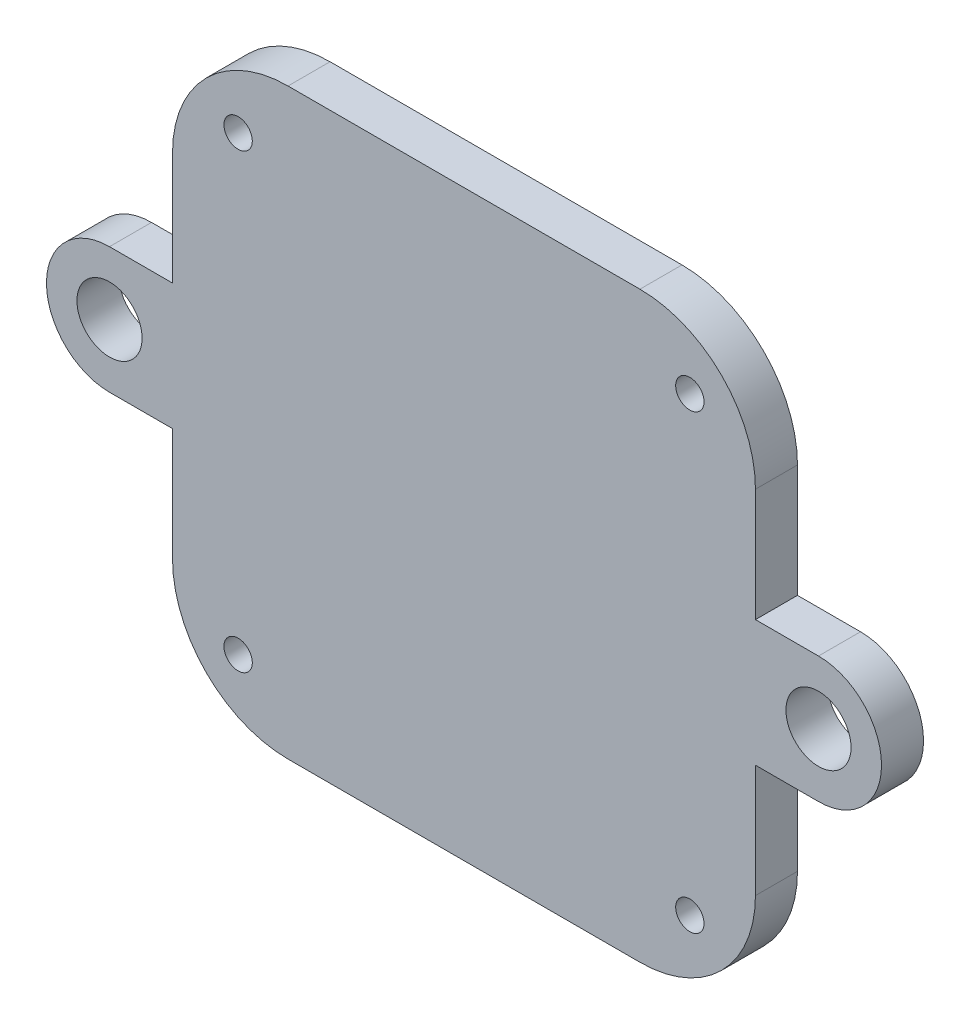
ISO-10303-21;
HEADER;
FILE_DESCRIPTION(('STEP AP214'),'2;1');
FILE_NAME('part.step','',(''),(''),'','','');
FILE_SCHEMA(('AUTOMOTIVE_DESIGN { 1 0 10303 214 1 1 1 1 }'));
ENDSEC;
DATA;
#1=APPLICATION_CONTEXT('core data for automotive mechanical design processes');
#2=APPLICATION_PROTOCOL_DEFINITION('international standard','automotive_design',2000,#1);
#3=PRODUCT_CONTEXT('',#1,'mechanical');
#4=PRODUCT('Part','Part','',(#3));
#5=PRODUCT_RELATED_PRODUCT_CATEGORY('part','',(#4));
#6=PRODUCT_DEFINITION_FORMATION('','',#4);
#7=PRODUCT_DEFINITION_CONTEXT('part definition',#1,'design');
#8=PRODUCT_DEFINITION('design','',#6,#7);
#9=PRODUCT_DEFINITION_SHAPE('','',#8);
#10=(LENGTH_UNIT() NAMED_UNIT(*) SI_UNIT(.MILLI.,.METRE.));
#11=(NAMED_UNIT(*) PLANE_ANGLE_UNIT() SI_UNIT($,.RADIAN.));
#12=(NAMED_UNIT(*) SI_UNIT($,.STERADIAN.) SOLID_ANGLE_UNIT());
#13=UNCERTAINTY_MEASURE_WITH_UNIT(LENGTH_MEASURE(1.E-05),#10,'distance_accuracy_value','');
#14=(GEOMETRIC_REPRESENTATION_CONTEXT(3) GLOBAL_UNCERTAINTY_ASSIGNED_CONTEXT((#13)) GLOBAL_UNIT_ASSIGNED_CONTEXT((#10,
#11,#12)) REPRESENTATION_CONTEXT('',''));
#15=CARTESIAN_POINT('',(0.,0.,0.));
#16=DIRECTION('',(0.,0.,1.));
#17=DIRECTION('',(1.,0.,0.));
#18=AXIS2_PLACEMENT_3D('',#15,#16,#17);
#19=CARTESIAN_POINT('',(33.744938630528,0.,-4.));
#20=DIRECTION('',(0.,0.,1.));
#21=DIRECTION('',(1.,0.,0.));
#22=AXIS2_PLACEMENT_3D('',#19,#20,#21);
#23=CYLINDRICAL_SURFACE('',#22,6.);
#24=CARTESIAN_POINT('',(33.744938630528,0.,0.));
#25=DIRECTION('',(0.,0.,1.));
#26=DIRECTION('',(1.,0.,0.));
#27=AXIS2_PLACEMENT_3D('',#24,#25,#26);
#28=CIRCLE('',#27,6.);
#29=CARTESIAN_POINT('',(33.744938630528,6.00000000000001,0.));
#30=VERTEX_POINT('',#29);
#31=CARTESIAN_POINT('',(33.744938630528,-6.,0.));
#32=VERTEX_POINT('',#31);
#33=EDGE_CURVE('E203',#30,#32,#28,.F.);
#34=ORIENTED_EDGE('',*,*,#33,.T.);
#35=DIRECTION('',(0.,0.,1.));
#36=VECTOR('',#35,1.);
#37=CARTESIAN_POINT('',(33.744938630528,-6.,-4.));
#38=LINE('',#37,#36);
#39=CARTESIAN_POINT('',(33.744938630528,-6.,-4.));
#40=VERTEX_POINT('',#39);
#41=EDGE_CURVE('E11',#40,#32,#38,.T.);
#42=ORIENTED_EDGE('',*,*,#41,.F.);
#43=CARTESIAN_POINT('',(33.744938630528,0.,-4.));
#44=DIRECTION('',(0.,0.,1.));
#45=DIRECTION('',(1.,0.,0.));
#46=AXIS2_PLACEMENT_3D('',#43,#44,#45);
#47=CIRCLE('',#46,6.);
#48=CARTESIAN_POINT('',(33.744938630528,6.00000000000001,-4.));
#49=VERTEX_POINT('',#48);
#50=EDGE_CURVE('E273',#49,#40,#47,.F.);
#51=ORIENTED_EDGE('',*,*,#50,.F.);
#52=DIRECTION('',(0.,0.,1.));
#53=VECTOR('',#52,1.);
#54=CARTESIAN_POINT('',(33.744938630528,6.00000000000001,-4.));
#55=LINE('',#54,#53);
#56=EDGE_CURVE('E126',#49,#30,#55,.T.);
#57=ORIENTED_EDGE('',*,*,#56,.T.);
#58=EDGE_LOOP('',(#34,#42,#51,#57));
#59=FACE_BOUND('',#58,.T.);
#60=ADVANCED_FACE('F40',(#59),#23,.T.);
#61=CARTESIAN_POINT('',(0.,-6.00000000000002,-4.));
#62=DIRECTION('',(0.,1.,0.));
#63=DIRECTION('',(-1.,0.,0.));
#64=AXIS2_PLACEMENT_3D('',#61,#62,#63);
#65=PLANE('',#64);
#66=DIRECTION('',(-1.,0.,0.));
#67=VECTOR('',#66,1.);
#68=CARTESIAN_POINT('',(0.,-6.00000000000002,0.));
#69=LINE('',#68,#67);
#70=CARTESIAN_POINT('',(27.7449386305214,-6.00000000000002,0.));
#71=VERTEX_POINT('',#70);
#72=EDGE_CURVE('E119',#32,#71,#69,.T.);
#73=ORIENTED_EDGE('',*,*,#72,.T.);
#74=DIRECTION('',(0.,0.,1.));
#75=VECTOR('',#74,1.);
#76=CARTESIAN_POINT('',(27.7449386305214,-6.00000000000002,-4.));
#77=LINE('',#76,#75);
#78=CARTESIAN_POINT('',(27.7449386305214,-6.00000000000002,-4.));
#79=VERTEX_POINT('',#78);
#80=EDGE_CURVE('E49',#79,#71,#77,.T.);
#81=ORIENTED_EDGE('',*,*,#80,.F.);
#82=DIRECTION('',(-1.,0.,0.));
#83=VECTOR('',#82,1.);
#84=CARTESIAN_POINT('',(0.,-6.00000000000002,-4.));
#85=LINE('',#84,#83);
#86=EDGE_CURVE('E57',#40,#79,#85,.T.);
#87=ORIENTED_EDGE('',*,*,#86,.F.);
#88=ORIENTED_EDGE('',*,*,#41,.T.);
#89=EDGE_LOOP('',(#73,#81,#87,#88));
#90=FACE_BOUND('',#89,.T.);
#91=ADVANCED_FACE('F424',(#90),#65,.F.);
#92=CARTESIAN_POINT('',(27.7449386305203,5.17503071897234E-12,-4.));
#93=DIRECTION('',(1.,1.86521613469336E-13,0.));
#94=DIRECTION('',(-1.86521613469336E-13,1.,0.));
#95=AXIS2_PLACEMENT_3D('',#92,#93,#94);
#96=PLANE('',#95);
#97=DIRECTION('',(-1.86521613469336E-13,1.,0.));
#98=VECTOR('',#97,1.);
#99=CARTESIAN_POINT('',(27.7449386305203,5.17503071897234E-12,0.));
#100=LINE('',#99,#98);
#101=CARTESIAN_POINT('',(27.7449386305234,-16.749999513438,0.));
#102=VERTEX_POINT('',#101);
#103=EDGE_CURVE('E173',#102,#71,#100,.T.);
#104=ORIENTED_EDGE('',*,*,#103,.F.);
#105=DIRECTION('',(0.,0.,1.));
#106=VECTOR('',#105,1.);
#107=CARTESIAN_POINT('',(27.7449386305234,-16.749999513438,-4.));
#108=LINE('',#107,#106);
#109=CARTESIAN_POINT('',(27.7449386305234,-16.749999513438,-4.));
#110=VERTEX_POINT('',#109);
#111=EDGE_CURVE('E169',#110,#102,#108,.T.);
#112=ORIENTED_EDGE('',*,*,#111,.F.);
#113=DIRECTION('',(-1.86521613469336E-13,1.,0.));
#114=VECTOR('',#113,1.);
#115=CARTESIAN_POINT('',(27.7449386305203,5.17503071897234E-12,-4.));
#116=LINE('',#115,#114);
#117=EDGE_CURVE('E172',#110,#79,#116,.T.);
#118=ORIENTED_EDGE('',*,*,#117,.T.);
#119=ORIENTED_EDGE('',*,*,#80,.T.);
#120=EDGE_LOOP('',(#104,#112,#118,#119));
#121=FACE_BOUND('',#120,.T.);
#122=ADVANCED_FACE('F171',(#121),#96,.T.);
#123=CARTESIAN_POINT('',(16.75,-16.75,-4.));
#124=DIRECTION('',(0.,0.,1.));
#125=DIRECTION('',(1.,0.,0.));
#126=AXIS2_PLACEMENT_3D('',#123,#124,#125);
#127=CYLINDRICAL_SURFACE('',#126,10.9949386305203);
#128=CARTESIAN_POINT('',(16.75,-16.75,0.));
#129=DIRECTION('',(0.,0.,1.));
#130=DIRECTION('',(1.,0.,0.));
#131=AXIS2_PLACEMENT_3D('',#128,#129,#130);
#132=CIRCLE('',#131,10.9949386305203);
#133=CARTESIAN_POINT('',(16.75,-27.7449386305172,0.));
#134=VERTEX_POINT('',#133);
#135=EDGE_CURVE('E250',#134,#102,#132,.T.);
#136=ORIENTED_EDGE('',*,*,#135,.F.);
#137=DIRECTION('',(0.,0.,1.));
#138=VECTOR('',#137,1.);
#139=CARTESIAN_POINT('',(16.75,-27.7449386305172,-4.));
#140=LINE('',#139,#138);
#141=CARTESIAN_POINT('',(16.75,-27.7449386305172,-4.));
#142=VERTEX_POINT('',#141);
#143=EDGE_CURVE('E178',#142,#134,#140,.T.);
#144=ORIENTED_EDGE('',*,*,#143,.F.);
#145=CARTESIAN_POINT('',(16.75,-16.75,-4.));
#146=DIRECTION('',(0.,0.,1.));
#147=DIRECTION('',(1.,0.,0.));
#148=AXIS2_PLACEMENT_3D('',#145,#146,#147);
#149=CIRCLE('',#148,10.9949386305203);
#150=EDGE_CURVE('E184',#142,#110,#149,.T.);
#151=ORIENTED_EDGE('',*,*,#150,.T.);
#152=ORIENTED_EDGE('',*,*,#111,.T.);
#153=EDGE_LOOP('',(#136,#144,#151,#152));
#154=FACE_BOUND('',#153,.T.);
#155=ADVANCED_FACE('F186',(#154),#127,.T.);
#156=CARTESIAN_POINT('',(1.03098335431308E-11,-27.7449386305234,-4.));
#157=DIRECTION('',(-3.71593308618407E-13,1.,0.));
#158=DIRECTION('',(-1.,-3.71593308618407E-13,0.));
#159=AXIS2_PLACEMENT_3D('',#156,#157,#158);
#160=PLANE('',#159);
#161=DIRECTION('',(-1.,-3.71593308618407E-13,0.));
#162=VECTOR('',#161,1.);
#163=CARTESIAN_POINT('',(1.03098335431308E-11,-27.7449386305234,0.));
#164=LINE('',#163,#162);
#165=CARTESIAN_POINT('',(-16.7499995287669,-27.7449386305296,0.));
#166=VERTEX_POINT('',#165);
#167=EDGE_CURVE('E246',#134,#166,#164,.T.);
#168=ORIENTED_EDGE('',*,*,#167,.T.);
#169=DIRECTION('',(0.,0.,1.));
#170=VECTOR('',#169,1.);
#171=CARTESIAN_POINT('',(-16.7499995287669,-27.7449386305296,-4.));
#172=LINE('',#171,#170);
#173=CARTESIAN_POINT('',(-16.7499995287669,-27.7449386305296,-4.));
#174=VERTEX_POINT('',#173);
#175=EDGE_CURVE('E277',#174,#166,#172,.T.);
#176=ORIENTED_EDGE('',*,*,#175,.F.);
#177=DIRECTION('',(-1.,-3.71593308618407E-13,0.));
#178=VECTOR('',#177,1.);
#179=CARTESIAN_POINT('',(1.03098335431308E-11,-27.7449386305234,-4.));
#180=LINE('',#179,#178);
#181=EDGE_CURVE('E188',#142,#174,#180,.T.);
#182=ORIENTED_EDGE('',*,*,#181,.F.);
#183=ORIENTED_EDGE('',*,*,#143,.T.);
#184=EDGE_LOOP('',(#168,#176,#182,#183));
#185=FACE_BOUND('',#184,.T.);
#186=ADVANCED_FACE('F427',(#185),#160,.F.);
#187=CARTESIAN_POINT('',(-16.75,-16.75,-4.));
#188=DIRECTION('',(0.,0.,1.));
#189=DIRECTION('',(1.,0.,0.));
#190=AXIS2_PLACEMENT_3D('',#187,#188,#189);
#191=CYLINDRICAL_SURFACE('',#190,10.9949386305288);
#192=CARTESIAN_POINT('',(-16.75,-16.75,0.));
#193=DIRECTION('',(0.,0.,1.));
#194=DIRECTION('',(1.,0.,0.));
#195=AXIS2_PLACEMENT_3D('',#192,#193,#194);
#196=CIRCLE('',#195,10.9949386305288);
#197=CARTESIAN_POINT('',(-27.744938630528,-16.7500000000466,0.));
#198=VERTEX_POINT('',#197);
#199=EDGE_CURVE('E242',#198,#166,#196,.T.);
#200=ORIENTED_EDGE('',*,*,#199,.F.);
#201=DIRECTION('',(0.,0.,1.));
#202=VECTOR('',#201,1.);
#203=CARTESIAN_POINT('',(-27.744938630528,-16.7500000000466,-4.));
#204=LINE('',#203,#202);
#205=CARTESIAN_POINT('',(-27.744938630528,-16.7500000000466,-4.));
#206=VERTEX_POINT('',#205);
#207=EDGE_CURVE('E279',#206,#198,#204,.T.);
#208=ORIENTED_EDGE('',*,*,#207,.F.);
#209=CARTESIAN_POINT('',(-16.75,-16.75,-4.));
#210=DIRECTION('',(0.,0.,1.));
#211=DIRECTION('',(1.,0.,0.));
#212=AXIS2_PLACEMENT_3D('',#209,#210,#211);
#213=CIRCLE('',#212,10.9949386305288);
#214=EDGE_CURVE('E191',#206,#174,#213,.T.);
#215=ORIENTED_EDGE('',*,*,#214,.T.);
#216=ORIENTED_EDGE('',*,*,#175,.T.);
#217=EDGE_LOOP('',(#200,#208,#215,#216));
#218=FACE_BOUND('',#217,.T.);
#219=ADVANCED_FACE('F380',(#218),#191,.T.);
#220=CARTESIAN_POINT('',(-27.7449386305288,-1.36487482276882E-12,-4.));
#221=DIRECTION('',(-1.,0.,0.));
#222=DIRECTION('',(0.,-1.,0.));
#223=AXIS2_PLACEMENT_3D('',#220,#221,#222);
#224=PLANE('',#223);
#225=DIRECTION('',(0.,-1.,0.));
#226=VECTOR('',#225,1.);
#227=CARTESIAN_POINT('',(-27.7449386305288,-1.36487482276882E-12,0.));
#228=LINE('',#227,#226);
#229=CARTESIAN_POINT('',(-27.7449386305285,-6.00000000000002,0.));
#230=VERTEX_POINT('',#229);
#231=EDGE_CURVE('E238',#230,#198,#228,.T.);
#232=ORIENTED_EDGE('',*,*,#231,.F.);
#233=DIRECTION('',(0.,0.,1.));
#234=VECTOR('',#233,1.);
#235=CARTESIAN_POINT('',(-27.7449386305285,-6.00000000000002,-4.));
#236=LINE('',#235,#234);
#237=CARTESIAN_POINT('',(-27.7449386305285,-6.00000000000002,-4.));
#238=VERTEX_POINT('',#237);
#239=EDGE_CURVE('E282',#238,#230,#236,.T.);
#240=ORIENTED_EDGE('',*,*,#239,.F.);
#241=DIRECTION('',(0.,-1.,0.));
#242=VECTOR('',#241,1.);
#243=CARTESIAN_POINT('',(-27.7449386305288,-1.36487482276882E-12,-4.));
#244=LINE('',#243,#242);
#245=EDGE_CURVE('E372',#238,#206,#244,.T.);
#246=ORIENTED_EDGE('',*,*,#245,.T.);
#247=ORIENTED_EDGE('',*,*,#207,.T.);
#248=EDGE_LOOP('',(#232,#240,#246,#247));
#249=FACE_BOUND('',#248,.T.);
#250=ADVANCED_FACE('F385',(#249),#224,.T.);
#251=CARTESIAN_POINT('',(0.,-6.00000000000002,-4.));
#252=DIRECTION('',(0.,1.,0.));
#253=DIRECTION('',(-1.,0.,0.));
#254=AXIS2_PLACEMENT_3D('',#251,#252,#253);
#255=PLANE('',#254);
#256=DIRECTION('',(-1.,0.,0.));
#257=VECTOR('',#256,1.);
#258=CARTESIAN_POINT('',(0.,-6.00000000000002,0.));
#259=LINE('',#258,#257);
#260=CARTESIAN_POINT('',(-33.744938630528,-6.00000000000001,0.));
#261=VERTEX_POINT('',#260);
#262=EDGE_CURVE('E234',#230,#261,#259,.T.);
#263=ORIENTED_EDGE('',*,*,#262,.T.);
#264=DIRECTION('',(0.,0.,1.));
#265=VECTOR('',#264,1.);
#266=CARTESIAN_POINT('',(-33.744938630528,-6.00000000000001,-4.));
#267=LINE('',#266,#265);
#268=CARTESIAN_POINT('',(-33.744938630528,-6.00000000000001,-4.));
#269=VERTEX_POINT('',#268);
#270=EDGE_CURVE('E285',#269,#261,#267,.T.);
#271=ORIENTED_EDGE('',*,*,#270,.F.);
#272=DIRECTION('',(-1.,0.,0.));
#273=VECTOR('',#272,1.);
#274=CARTESIAN_POINT('',(0.,-6.00000000000002,-4.));
#275=LINE('',#274,#273);
#276=EDGE_CURVE('E369',#238,#269,#275,.T.);
#277=ORIENTED_EDGE('',*,*,#276,.F.);
#278=ORIENTED_EDGE('',*,*,#239,.T.);
#279=EDGE_LOOP('',(#263,#271,#277,#278));
#280=FACE_BOUND('',#279,.T.);
#281=ADVANCED_FACE('F390',(#280),#255,.F.);
#282=CARTESIAN_POINT('',(-33.744938630528,0.,-4.));
#283=DIRECTION('',(0.,0.,1.));
#284=DIRECTION('',(1.,0.,0.));
#285=AXIS2_PLACEMENT_3D('',#282,#283,#284);
#286=CYLINDRICAL_SURFACE('',#285,6.);
#287=CARTESIAN_POINT('',(-33.744938630528,0.,0.));
#288=DIRECTION('',(0.,0.,1.));
#289=DIRECTION('',(1.,0.,0.));
#290=AXIS2_PLACEMENT_3D('',#287,#288,#289);
#291=CIRCLE('',#290,6.);
#292=CARTESIAN_POINT('',(-33.744938630528,6.00000000000001,0.));
#293=VERTEX_POINT('',#292);
#294=EDGE_CURVE('E230',#293,#261,#291,.T.);
#295=ORIENTED_EDGE('',*,*,#294,.F.);
#296=DIRECTION('',(0.,0.,1.));
#297=VECTOR('',#296,1.);
#298=CARTESIAN_POINT('',(-33.744938630528,6.00000000000001,-4.));
#299=LINE('',#298,#297);
#300=CARTESIAN_POINT('',(-33.744938630528,6.00000000000001,-4.));
#301=VERTEX_POINT('',#300);
#302=EDGE_CURVE('E288',#301,#293,#299,.T.);
#303=ORIENTED_EDGE('',*,*,#302,.F.);
#304=CARTESIAN_POINT('',(-33.744938630528,0.,-4.));
#305=DIRECTION('',(0.,0.,1.));
#306=DIRECTION('',(1.,0.,0.));
#307=AXIS2_PLACEMENT_3D('',#304,#305,#306);
#308=CIRCLE('',#307,6.);
#309=EDGE_CURVE('E365',#301,#269,#308,.T.);
#310=ORIENTED_EDGE('',*,*,#309,.T.);
#311=ORIENTED_EDGE('',*,*,#270,.T.);
#312=EDGE_LOOP('',(#295,#303,#310,#311));
#313=FACE_BOUND('',#312,.T.);
#314=ADVANCED_FACE('F637',(#313),#286,.T.);
#315=CARTESIAN_POINT('',(0.,6.00000000000002,-4.));
#316=DIRECTION('',(0.,1.,0.));
#317=DIRECTION('',(-1.,0.,0.));
#318=AXIS2_PLACEMENT_3D('',#315,#316,#317);
#319=PLANE('',#318);
#320=DIRECTION('',(-1.,0.,0.));
#321=VECTOR('',#320,1.);
#322=CARTESIAN_POINT('',(0.,6.00000000000002,0.));
#323=LINE('',#322,#321);
#324=CARTESIAN_POINT('',(-27.7449386305291,6.00000000000002,0.));
#325=VERTEX_POINT('',#324);
#326=EDGE_CURVE('E226',#325,#293,#323,.T.);
#327=ORIENTED_EDGE('',*,*,#326,.F.);
#328=DIRECTION('',(0.,0.,1.));
#329=VECTOR('',#328,1.);
#330=CARTESIAN_POINT('',(-27.7449386305291,6.00000000000002,-4.));
#331=LINE('',#330,#329);
#332=CARTESIAN_POINT('',(-27.7449386305291,6.00000000000002,-4.));
#333=VERTEX_POINT('',#332);
#334=EDGE_CURVE('E290',#333,#325,#331,.T.);
#335=ORIENTED_EDGE('',*,*,#334,.F.);
#336=DIRECTION('',(-1.,0.,0.));
#337=VECTOR('',#336,1.);
#338=CARTESIAN_POINT('',(0.,6.00000000000002,-4.));
#339=LINE('',#338,#337);
#340=EDGE_CURVE('E361',#333,#301,#339,.T.);
#341=ORIENTED_EDGE('',*,*,#340,.T.);
#342=ORIENTED_EDGE('',*,*,#302,.T.);
#343=EDGE_LOOP('',(#327,#335,#341,#342));
#344=FACE_BOUND('',#343,.T.);
#345=ADVANCED_FACE('F397',(#344),#319,.T.);
#346=CARTESIAN_POINT('',(-27.7449386305288,-1.36487482276882E-12,-4.));
#347=DIRECTION('',(-1.,0.,0.));
#348=DIRECTION('',(0.,-1.,0.));
#349=AXIS2_PLACEMENT_3D('',#346,#347,#348);
#350=PLANE('',#349);
#351=DIRECTION('',(0.,-1.,0.));
#352=VECTOR('',#351,1.);
#353=CARTESIAN_POINT('',(-27.7449386305288,-1.36487482276882E-12,0.));
#354=LINE('',#353,#352);
#355=CARTESIAN_POINT('',(-27.7449386305296,16.7499999999996,0.));
#356=VERTEX_POINT('',#355);
#357=EDGE_CURVE('E222',#356,#325,#354,.T.);
#358=ORIENTED_EDGE('',*,*,#357,.F.);
#359=DIRECTION('',(0.,0.,1.));
#360=VECTOR('',#359,1.);
#361=CARTESIAN_POINT('',(-27.7449386305296,16.7499999999996,-4.));
#362=LINE('',#361,#360);
#363=CARTESIAN_POINT('',(-27.7449386305296,16.7499999999996,-4.));
#364=VERTEX_POINT('',#363);
#365=EDGE_CURVE('E293',#364,#356,#362,.T.);
#366=ORIENTED_EDGE('',*,*,#365,.F.);
#367=DIRECTION('',(0.,-1.,0.));
#368=VECTOR('',#367,1.);
#369=CARTESIAN_POINT('',(-27.7449386305288,-1.36487482276882E-12,-4.));
#370=LINE('',#369,#368);
#371=EDGE_CURVE('E357',#364,#333,#370,.T.);
#372=ORIENTED_EDGE('',*,*,#371,.T.);
#373=ORIENTED_EDGE('',*,*,#334,.T.);
#374=EDGE_LOOP('',(#358,#366,#372,#373));
#375=FACE_BOUND('',#374,.T.);
#376=ADVANCED_FACE('F401',(#375),#350,.T.);
#377=CARTESIAN_POINT('',(-16.749999999938,16.750000000062,-4.));
#378=DIRECTION('',(0.,0.,1.));
#379=DIRECTION('',(1.,0.,0.));
#380=AXIS2_PLACEMENT_3D('',#377,#378,#379);
#381=CYLINDRICAL_SURFACE('',#380,10.9949386305635);
#382=CARTESIAN_POINT('',(-16.749999999938,16.750000000062,0.));
#383=DIRECTION('',(0.,0.,1.));
#384=DIRECTION('',(1.,0.,0.));
#385=AXIS2_PLACEMENT_3D('',#382,#383,#384);
#386=CIRCLE('',#385,10.9949386305635);
#387=CARTESIAN_POINT('',(-16.75,27.7449386305975,0.));
#388=VERTEX_POINT('',#387);
#389=EDGE_CURVE('E219',#388,#356,#386,.T.);
#390=ORIENTED_EDGE('',*,*,#389,.F.);
#391=DIRECTION('',(0.,0.,1.));
#392=VECTOR('',#391,1.);
#393=CARTESIAN_POINT('',(-16.75,27.7449386305975,-4.));
#394=LINE('',#393,#392);
#395=CARTESIAN_POINT('',(-16.75,27.7449386305975,-4.));
#396=VERTEX_POINT('',#395);
#397=EDGE_CURVE('E296',#396,#388,#394,.T.);
#398=ORIENTED_EDGE('',*,*,#397,.F.);
#399=CARTESIAN_POINT('',(-16.749999999938,16.750000000062,-4.));
#400=DIRECTION('',(0.,0.,1.));
#401=DIRECTION('',(1.,0.,0.));
#402=AXIS2_PLACEMENT_3D('',#399,#400,#401);
#403=CIRCLE('',#402,10.9949386305635);
#404=EDGE_CURVE('E353',#396,#364,#403,.T.);
#405=ORIENTED_EDGE('',*,*,#404,.T.);
#406=ORIENTED_EDGE('',*,*,#365,.T.);
#407=EDGE_LOOP('',(#390,#398,#405,#406));
#408=FACE_BOUND('',#407,.T.);
#409=ADVANCED_FACE('F406',(#408),#381,.T.);
#410=CARTESIAN_POINT('',(3.95899904431702E-11,27.7449386305736,-4.));
#411=DIRECTION('',(1.42692658182866E-12,1.,0.));
#412=DIRECTION('',(-1.,1.42692658182866E-12,0.));
#413=AXIS2_PLACEMENT_3D('',#410,#411,#412);
#414=PLANE('',#413);
#415=DIRECTION('',(-1.,1.42692658182866E-12,0.));
#416=VECTOR('',#415,1.);
#417=CARTESIAN_POINT('',(3.95899904431702E-11,27.7449386305736,0.));
#418=LINE('',#417,#416);
#419=CARTESIAN_POINT('',(16.7499997286173,27.7449386305497,0.));
#420=VERTEX_POINT('',#419);
#421=EDGE_CURVE('E216',#420,#388,#418,.T.);
#422=ORIENTED_EDGE('',*,*,#421,.F.);
#423=DIRECTION('',(0.,0.,1.));
#424=VECTOR('',#423,1.);
#425=CARTESIAN_POINT('',(16.7499997286173,27.7449386305497,-4.));
#426=LINE('',#425,#424);
#427=CARTESIAN_POINT('',(16.7499997286173,27.7449386305497,-4.));
#428=VERTEX_POINT('',#427);
#429=EDGE_CURVE('E298',#428,#420,#426,.T.);
#430=ORIENTED_EDGE('',*,*,#429,.F.);
#431=DIRECTION('',(-1.,1.42692658182866E-12,0.));
#432=VECTOR('',#431,1.);
#433=CARTESIAN_POINT('',(3.95899904431702E-11,27.7449386305736,-4.));
#434=LINE('',#433,#432);
#435=EDGE_CURVE('E350',#428,#396,#434,.T.);
#436=ORIENTED_EDGE('',*,*,#435,.T.);
#437=ORIENTED_EDGE('',*,*,#397,.T.);
#438=EDGE_LOOP('',(#422,#430,#436,#437));
#439=FACE_BOUND('',#438,.T.);
#440=ADVANCED_FACE('F409',(#439),#414,.T.);
#441=CARTESIAN_POINT('',(16.75,16.75,-4.));
#442=DIRECTION('',(0.,0.,1.));
#443=DIRECTION('',(1.,0.,0.));
#444=AXIS2_PLACEMENT_3D('',#441,#442,#443);
#445=CYLINDRICAL_SURFACE('',#444,10.9949386305334);
#446=CARTESIAN_POINT('',(16.75,16.75,0.));
#447=DIRECTION('',(0.,0.,1.));
#448=DIRECTION('',(1.,0.,0.));
#449=AXIS2_PLACEMENT_3D('',#446,#447,#448);
#450=CIRCLE('',#449,10.9949386305334);
#451=CARTESIAN_POINT('',(27.7449386305172,16.7500000000003,0.));
#452=VERTEX_POINT('',#451);
#453=EDGE_CURVE('E213',#452,#420,#450,.T.);
#454=ORIENTED_EDGE('',*,*,#453,.F.);
#455=DIRECTION('',(0.,0.,1.));
#456=VECTOR('',#455,1.);
#457=CARTESIAN_POINT('',(27.7449386305172,16.7500000000003,-4.));
#458=LINE('',#457,#456);
#459=CARTESIAN_POINT('',(27.7449386305172,16.7500000000003,-4.));
#460=VERTEX_POINT('',#459);
#461=EDGE_CURVE('E300',#460,#452,#458,.T.);
#462=ORIENTED_EDGE('',*,*,#461,.F.);
#463=CARTESIAN_POINT('',(16.75,16.75,-4.));
#464=DIRECTION('',(0.,0.,1.));
#465=DIRECTION('',(1.,0.,0.));
#466=AXIS2_PLACEMENT_3D('',#463,#464,#465);
#467=CIRCLE('',#466,10.9949386305334);
#468=EDGE_CURVE('E347',#460,#428,#467,.T.);
#469=ORIENTED_EDGE('',*,*,#468,.T.);
#470=ORIENTED_EDGE('',*,*,#429,.T.);
#471=EDGE_LOOP('',(#454,#462,#469,#470));
#472=FACE_BOUND('',#471,.T.);
#473=ADVANCED_FACE('F414',(#472),#445,.T.);
#474=CARTESIAN_POINT('',(27.7449386305203,5.17503071897234E-12,-4.));
#475=DIRECTION('',(1.,1.86521613469336E-13,0.));
#476=DIRECTION('',(-1.86521613469336E-13,1.,0.));
#477=AXIS2_PLACEMENT_3D('',#474,#475,#476);
#478=PLANE('',#477);
#479=DIRECTION('',(-1.86521613469336E-13,1.,0.));
#480=VECTOR('',#479,1.);
#481=CARTESIAN_POINT('',(27.7449386305203,5.17503071897234E-12,0.));
#482=LINE('',#481,#480);
#483=CARTESIAN_POINT('',(27.7449386305192,6.00000000000002,0.));
#484=VERTEX_POINT('',#483);
#485=EDGE_CURVE('E210',#484,#452,#482,.T.);
#486=ORIENTED_EDGE('',*,*,#485,.F.);
#487=DIRECTION('',(0.,0.,1.));
#488=VECTOR('',#487,1.);
#489=CARTESIAN_POINT('',(27.7449386305192,6.00000000000002,-4.));
#490=LINE('',#489,#488);
#491=CARTESIAN_POINT('',(27.7449386305192,6.00000000000002,-4.));
#492=VERTEX_POINT('',#491);
#493=EDGE_CURVE('E302',#492,#484,#490,.T.);
#494=ORIENTED_EDGE('',*,*,#493,.F.);
#495=DIRECTION('',(-1.86521613469336E-13,1.,0.));
#496=VECTOR('',#495,1.);
#497=CARTESIAN_POINT('',(27.7449386305203,5.17503071897234E-12,-4.));
#498=LINE('',#497,#496);
#499=EDGE_CURVE('E344',#492,#460,#498,.T.);
#500=ORIENTED_EDGE('',*,*,#499,.T.);
#501=ORIENTED_EDGE('',*,*,#461,.T.);
#502=EDGE_LOOP('',(#486,#494,#500,#501));
#503=FACE_BOUND('',#502,.T.);
#504=ADVANCED_FACE('F417',(#503),#478,.T.);
#505=CARTESIAN_POINT('',(-33.744938630528,0.,-4.));
#506=DIRECTION('',(0.,0.,1.));
#507=DIRECTION('',(1.,0.,0.));
#508=AXIS2_PLACEMENT_3D('',#505,#506,#507);
#509=CYLINDRICAL_SURFACE('',#508,3.1);
#510=CARTESIAN_POINT('',(-33.744938630528,0.,-4.));
#511=DIRECTION('',(0.,0.,1.));
#512=DIRECTION('',(1.,0.,0.));
#513=AXIS2_PLACEMENT_3D('',#510,#511,#512);
#514=CIRCLE('',#513,3.1);
#515=CARTESIAN_POINT('',(-30.644938630528,0.,-4.));
#516=VERTEX_POINT('',#515);
#517=EDGE_CURVE('E196',#516,#516,#514,.T.);
#518=ORIENTED_EDGE('',*,*,#517,.F.);
#519=EDGE_LOOP('',(#518));
#520=FACE_BOUND('',#519,.T.);
#521=CARTESIAN_POINT('',(-33.744938630528,0.,0.));
#522=DIRECTION('',(0.,0.,1.));
#523=DIRECTION('',(1.,0.,0.));
#524=AXIS2_PLACEMENT_3D('',#521,#522,#523);
#525=CIRCLE('',#524,3.1);
#526=CARTESIAN_POINT('',(-30.644938630528,0.,0.));
#527=VERTEX_POINT('',#526);
#528=EDGE_CURVE('E267',#527,#527,#525,.T.);
#529=ORIENTED_EDGE('',*,*,#528,.T.);
#530=EDGE_LOOP('',(#529));
#531=FACE_BOUND('',#530,.T.);
#532=ADVANCED_FACE('F460',(#520,#531),#509,.F.);
#533=CARTESIAN_POINT('',(-21.5,-21.5,-4.));
#534=DIRECTION('',(0.,0.,1.));
#535=DIRECTION('',(1.,0.,0.));
#536=AXIS2_PLACEMENT_3D('',#533,#534,#535);
#537=CYLINDRICAL_SURFACE('',#536,1.35);
#538=CARTESIAN_POINT('',(-21.5,-21.5,-2.55));
#539=DIRECTION('',(0.,0.,-1.));
#540=DIRECTION('',(-1.,0.,0.));
#541=AXIS2_PLACEMENT_3D('',#538,#539,#540);
#542=CIRCLE('',#541,1.35);
#543=CARTESIAN_POINT('',(-22.85,-21.5,-2.55));
#544=VERTEX_POINT('',#543);
#545=EDGE_CURVE('E308',#544,#544,#542,.T.);
#546=ORIENTED_EDGE('',*,*,#545,.T.);
#547=EDGE_LOOP('',(#546));
#548=FACE_BOUND('',#547,.T.);
#549=CARTESIAN_POINT('',(-21.5,-21.5,0.));
#550=DIRECTION('',(0.,0.,1.));
#551=DIRECTION('',(1.,0.,0.));
#552=AXIS2_PLACEMENT_3D('',#549,#550,#551);
#553=CIRCLE('',#552,1.35);
#554=CARTESIAN_POINT('',(-20.15,-21.5,0.));
#555=VERTEX_POINT('',#554);
#556=EDGE_CURVE('E263',#555,#555,#553,.T.);
#557=ORIENTED_EDGE('',*,*,#556,.T.);
#558=EDGE_LOOP('',(#557));
#559=FACE_BOUND('',#558,.T.);
#560=ADVANCED_FACE('F456',(#548,#559),#537,.F.);
#561=CARTESIAN_POINT('',(21.5,-21.5,-4.));
#562=DIRECTION('',(0.,0.,1.));
#563=DIRECTION('',(1.,0.,0.));
#564=AXIS2_PLACEMENT_3D('',#561,#562,#563);
#565=CYLINDRICAL_SURFACE('',#564,1.35);
#566=CARTESIAN_POINT('',(21.5,-21.5,-2.55));
#567=DIRECTION('',(0.,0.,-1.));
#568=DIRECTION('',(-1.,0.,0.));
#569=AXIS2_PLACEMENT_3D('',#566,#567,#568);
#570=CIRCLE('',#569,1.35);
#571=CARTESIAN_POINT('',(20.15,-21.5,-2.55));
#572=VERTEX_POINT('',#571);
#573=EDGE_CURVE('E207',#572,#572,#570,.T.);
#574=ORIENTED_EDGE('',*,*,#573,.T.);
#575=EDGE_LOOP('',(#574));
#576=FACE_BOUND('',#575,.T.);
#577=CARTESIAN_POINT('',(21.5,-21.5,0.));
#578=DIRECTION('',(0.,0.,1.));
#579=DIRECTION('',(1.,0.,0.));
#580=AXIS2_PLACEMENT_3D('',#577,#578,#579);
#581=CIRCLE('',#580,1.35);
#582=CARTESIAN_POINT('',(22.85,-21.5,0.));
#583=VERTEX_POINT('',#582);
#584=EDGE_CURVE('E260',#583,#583,#581,.T.);
#585=ORIENTED_EDGE('',*,*,#584,.T.);
#586=EDGE_LOOP('',(#585));
#587=FACE_BOUND('',#586,.T.);
#588=ADVANCED_FACE('F452',(#576,#587),#565,.F.);
#589=CARTESIAN_POINT('',(21.5,21.5,-4.));
#590=DIRECTION('',(0.,0.,1.));
#591=DIRECTION('',(1.,0.,0.));
#592=AXIS2_PLACEMENT_3D('',#589,#590,#591);
#593=CYLINDRICAL_SURFACE('',#592,1.35);
#594=CARTESIAN_POINT('',(21.5,21.5,-2.55));
#595=DIRECTION('',(0.,0.,-1.));
#596=DIRECTION('',(-1.,0.,0.));
#597=AXIS2_PLACEMENT_3D('',#594,#595,#596);
#598=CIRCLE('',#597,1.35);
#599=CARTESIAN_POINT('',(20.15,21.5,-2.55));
#600=VERTEX_POINT('',#599);
#601=EDGE_CURVE('E43',#600,#600,#598,.T.);
#602=ORIENTED_EDGE('',*,*,#601,.T.);
#603=EDGE_LOOP('',(#602));
#604=FACE_BOUND('',#603,.T.);
#605=CARTESIAN_POINT('',(21.5,21.5,0.));
#606=DIRECTION('',(0.,0.,1.));
#607=DIRECTION('',(1.,0.,0.));
#608=AXIS2_PLACEMENT_3D('',#605,#606,#607);
#609=CIRCLE('',#608,1.35);
#610=CARTESIAN_POINT('',(22.85,21.5,0.));
#611=VERTEX_POINT('',#610);
#612=EDGE_CURVE('E257',#611,#611,#609,.T.);
#613=ORIENTED_EDGE('',*,*,#612,.T.);
#614=EDGE_LOOP('',(#613));
#615=FACE_BOUND('',#614,.T.);
#616=ADVANCED_FACE('F449',(#604,#615),#593,.F.);
#617=CARTESIAN_POINT('',(-21.5,21.5,-4.));
#618=DIRECTION('',(0.,0.,1.));
#619=DIRECTION('',(1.,0.,0.));
#620=AXIS2_PLACEMENT_3D('',#617,#618,#619);
#621=CYLINDRICAL_SURFACE('',#620,1.35);
#622=CARTESIAN_POINT('',(-21.5,21.5,-2.55));
#623=DIRECTION('',(0.,0.,-1.));
#624=DIRECTION('',(-1.,0.,0.));
#625=AXIS2_PLACEMENT_3D('',#622,#623,#624);
#626=CIRCLE('',#625,1.35);
#627=CARTESIAN_POINT('',(-22.85,21.5,-2.55));
#628=VERTEX_POINT('',#627);
#629=EDGE_CURVE('E313',#628,#628,#626,.T.);
#630=ORIENTED_EDGE('',*,*,#629,.T.);
#631=EDGE_LOOP('',(#630));
#632=FACE_BOUND('',#631,.T.);
#633=CARTESIAN_POINT('',(-21.5,21.5,0.));
#634=DIRECTION('',(0.,0.,1.));
#635=DIRECTION('',(1.,0.,0.));
#636=AXIS2_PLACEMENT_3D('',#633,#634,#635);
#637=CIRCLE('',#636,1.35);
#638=CARTESIAN_POINT('',(-20.15,21.5,0.));
#639=VERTEX_POINT('',#638);
#640=EDGE_CURVE('E254',#639,#639,#637,.T.);
#641=ORIENTED_EDGE('',*,*,#640,.T.);
#642=EDGE_LOOP('',(#641));
#643=FACE_BOUND('',#642,.T.);
#644=ADVANCED_FACE('F446',(#632,#643),#621,.F.);
#645=CARTESIAN_POINT('',(0.,6.00000000000002,-4.));
#646=DIRECTION('',(0.,1.,0.));
#647=DIRECTION('',(-1.,0.,0.));
#648=AXIS2_PLACEMENT_3D('',#645,#646,#647);
#649=PLANE('',#648);
#650=DIRECTION('',(-1.,0.,0.));
#651=VECTOR('',#650,1.);
#652=CARTESIAN_POINT('',(0.,6.00000000000002,0.));
#653=LINE('',#652,#651);
#654=EDGE_CURVE('E206',#30,#484,#653,.T.);
#655=ORIENTED_EDGE('',*,*,#654,.F.);
#656=ORIENTED_EDGE('',*,*,#56,.F.);
#657=DIRECTION('',(-1.,0.,0.));
#658=VECTOR('',#657,1.);
#659=CARTESIAN_POINT('',(0.,6.00000000000002,-4.));
#660=LINE('',#659,#658);
#661=EDGE_CURVE('E342',#49,#492,#660,.T.);
#662=ORIENTED_EDGE('',*,*,#661,.T.);
#663=ORIENTED_EDGE('',*,*,#493,.T.);
#664=EDGE_LOOP('',(#655,#656,#662,#663));
#665=FACE_BOUND('',#664,.T.);
#666=ADVANCED_FACE('F419',(#665),#649,.T.);
#667=CARTESIAN_POINT('',(33.744938630528,0.,-4.));
#668=DIRECTION('',(0.,0.,1.));
#669=DIRECTION('',(1.,0.,0.));
#670=AXIS2_PLACEMENT_3D('',#667,#668,#669);
#671=CYLINDRICAL_SURFACE('',#670,3.1);
#672=CARTESIAN_POINT('',(33.744938630528,0.,-4.));
#673=DIRECTION('',(0.,0.,1.));
#674=DIRECTION('',(1.,0.,0.));
#675=AXIS2_PLACEMENT_3D('',#672,#673,#674);
#676=CIRCLE('',#675,3.1);
#677=CARTESIAN_POINT('',(36.8449386305279,0.,-4.));
#678=VERTEX_POINT('',#677);
#679=EDGE_CURVE('E200',#678,#678,#676,.F.);
#680=ORIENTED_EDGE('',*,*,#679,.T.);
#681=EDGE_LOOP('',(#680));
#682=FACE_BOUND('',#681,.T.);
#683=CARTESIAN_POINT('',(33.744938630528,0.,0.));
#684=DIRECTION('',(0.,0.,1.));
#685=DIRECTION('',(1.,0.,0.));
#686=AXIS2_PLACEMENT_3D('',#683,#684,#685);
#687=CIRCLE('',#686,3.1);
#688=CARTESIAN_POINT('',(36.8449386305279,0.,0.));
#689=VERTEX_POINT('',#688);
#690=EDGE_CURVE('E271',#689,#689,#687,.F.);
#691=ORIENTED_EDGE('',*,*,#690,.F.);
#692=EDGE_LOOP('',(#691));
#693=FACE_BOUND('',#692,.T.);
#694=ADVANCED_FACE('F465',(#682,#693),#671,.F.);
#695=CARTESIAN_POINT('',(0.,0.,-4.));
#696=DIRECTION('',(0.,0.,1.));
#697=DIRECTION('',(1.,0.,0.));
#698=AXIS2_PLACEMENT_3D('',#695,#696,#697);
#699=PLANE('',#698);
#700=CARTESIAN_POINT('',(21.5,21.5,-4.));
#701=DIRECTION('',(0.,0.,-1.));
#702=DIRECTION('',(-1.,0.,0.));
#703=AXIS2_PLACEMENT_3D('',#700,#701,#702);
#704=CIRCLE('',#703,2.5);
#705=CARTESIAN_POINT('',(19.,21.5,-4.));
#706=VERTEX_POINT('',#705);
#707=EDGE_CURVE('E512',#706,#706,#704,.T.);
#708=ORIENTED_EDGE('',*,*,#707,.F.);
#709=EDGE_LOOP('',(#708));
#710=FACE_BOUND('',#709,.T.);
#711=CARTESIAN_POINT('',(-21.5,21.5,-4.));
#712=DIRECTION('',(0.,0.,-1.));
#713=DIRECTION('',(-1.,0.,0.));
#714=AXIS2_PLACEMENT_3D('',#711,#712,#713);
#715=CIRCLE('',#714,2.5);
#716=CARTESIAN_POINT('',(-24.,21.5,-4.));
#717=VERTEX_POINT('',#716);
#718=EDGE_CURVE('E325',#717,#717,#715,.T.);
#719=ORIENTED_EDGE('',*,*,#718,.F.);
#720=EDGE_LOOP('',(#719));
#721=FACE_BOUND('',#720,.T.);
#722=CARTESIAN_POINT('',(-21.5,-21.5,-4.));
#723=DIRECTION('',(0.,0.,-1.));
#724=DIRECTION('',(-1.,0.,0.));
#725=AXIS2_PLACEMENT_3D('',#722,#723,#724);
#726=CIRCLE('',#725,2.5);
#727=CARTESIAN_POINT('',(-24.,-21.5,-4.));
#728=VERTEX_POINT('',#727);
#729=EDGE_CURVE('E316',#728,#728,#726,.T.);
#730=ORIENTED_EDGE('',*,*,#729,.F.);
#731=EDGE_LOOP('',(#730));
#732=FACE_BOUND('',#731,.T.);
#733=CARTESIAN_POINT('',(21.5,-21.5,-4.));
#734=DIRECTION('',(0.,0.,-1.));
#735=DIRECTION('',(-1.,0.,0.));
#736=AXIS2_PLACEMENT_3D('',#733,#734,#735);
#737=CIRCLE('',#736,2.5);
#738=CARTESIAN_POINT('',(19.,-21.5,-4.));
#739=VERTEX_POINT('',#738);
#740=EDGE_CURVE('E311',#739,#739,#737,.T.);
#741=ORIENTED_EDGE('',*,*,#740,.F.);
#742=EDGE_LOOP('',(#741));
#743=FACE_BOUND('',#742,.T.);
#744=ORIENTED_EDGE('',*,*,#50,.T.);
#745=ORIENTED_EDGE('',*,*,#86,.T.);
#746=ORIENTED_EDGE('',*,*,#117,.F.);
#747=ORIENTED_EDGE('',*,*,#150,.F.);
#748=ORIENTED_EDGE('',*,*,#181,.T.);
#749=ORIENTED_EDGE('',*,*,#214,.F.);
#750=ORIENTED_EDGE('',*,*,#245,.F.);
#751=ORIENTED_EDGE('',*,*,#276,.T.);
#752=ORIENTED_EDGE('',*,*,#309,.F.);
#753=ORIENTED_EDGE('',*,*,#340,.F.);
#754=ORIENTED_EDGE('',*,*,#371,.F.);
#755=ORIENTED_EDGE('',*,*,#404,.F.);
#756=ORIENTED_EDGE('',*,*,#435,.F.);
#757=ORIENTED_EDGE('',*,*,#468,.F.);
#758=ORIENTED_EDGE('',*,*,#499,.F.);
#759=ORIENTED_EDGE('',*,*,#661,.F.);
#760=EDGE_LOOP('',(#744,#745,#746,#747,#748,#749,#750,#751,#752,#753,#754,#755,#756,#757,#758,#759));
#761=FACE_BOUND('',#760,.T.);
#762=ORIENTED_EDGE('',*,*,#517,.T.);
#763=EDGE_LOOP('',(#762));
#764=FACE_BOUND('',#763,.T.);
#765=ORIENTED_EDGE('',*,*,#679,.F.);
#766=EDGE_LOOP('',(#765));
#767=FACE_BOUND('',#766,.T.);
#768=ADVANCED_FACE('F182',(#710,#721,#732,#743,#761,#764,#767),#699,.F.);
#769=CARTESIAN_POINT('',(0.,0.,0.));
#770=DIRECTION('',(0.,0.,1.));
#771=DIRECTION('',(1.,0.,0.));
#772=AXIS2_PLACEMENT_3D('',#769,#770,#771);
#773=PLANE('',#772);
#774=ORIENTED_EDGE('',*,*,#33,.F.);
#775=ORIENTED_EDGE('',*,*,#654,.T.);
#776=ORIENTED_EDGE('',*,*,#485,.T.);
#777=ORIENTED_EDGE('',*,*,#453,.T.);
#778=ORIENTED_EDGE('',*,*,#421,.T.);
#779=ORIENTED_EDGE('',*,*,#389,.T.);
#780=ORIENTED_EDGE('',*,*,#357,.T.);
#781=ORIENTED_EDGE('',*,*,#326,.T.);
#782=ORIENTED_EDGE('',*,*,#294,.T.);
#783=ORIENTED_EDGE('',*,*,#262,.F.);
#784=ORIENTED_EDGE('',*,*,#231,.T.);
#785=ORIENTED_EDGE('',*,*,#199,.T.);
#786=ORIENTED_EDGE('',*,*,#167,.F.);
#787=ORIENTED_EDGE('',*,*,#135,.T.);
#788=ORIENTED_EDGE('',*,*,#103,.T.);
#789=ORIENTED_EDGE('',*,*,#72,.F.);
#790=EDGE_LOOP('',(#774,#775,#776,#777,#778,#779,#780,#781,#782,#783,#784,#785,#786,#787,#788,#789));
#791=FACE_BOUND('',#790,.T.);
#792=ORIENTED_EDGE('',*,*,#640,.F.);
#793=EDGE_LOOP('',(#792));
#794=FACE_BOUND('',#793,.T.);
#795=ORIENTED_EDGE('',*,*,#612,.F.);
#796=EDGE_LOOP('',(#795));
#797=FACE_BOUND('',#796,.T.);
#798=ORIENTED_EDGE('',*,*,#584,.F.);
#799=EDGE_LOOP('',(#798));
#800=FACE_BOUND('',#799,.T.);
#801=ORIENTED_EDGE('',*,*,#556,.F.);
#802=EDGE_LOOP('',(#801));
#803=FACE_BOUND('',#802,.T.);
#804=ORIENTED_EDGE('',*,*,#528,.F.);
#805=EDGE_LOOP('',(#804));
#806=FACE_BOUND('',#805,.T.);
#807=ORIENTED_EDGE('',*,*,#690,.T.);
#808=EDGE_LOOP('',(#807));
#809=FACE_BOUND('',#808,.T.);
#810=ADVANCED_FACE('F420',(#791,#794,#797,#800,#803,#806,#809),#773,.T.);
#811=CARTESIAN_POINT('',(21.5,-21.5,-3.7));
#812=DIRECTION('',(0.,0.,-1.));
#813=DIRECTION('',(-1.,0.,0.));
#814=AXIS2_PLACEMENT_3D('',#811,#812,#813);
#815=CONICAL_SURFACE('',#814,2.5,0.785398163397448);
#816=CARTESIAN_POINT('',(21.5,-21.5,-3.7));
#817=DIRECTION('',(0.,0.,-1.));
#818=DIRECTION('',(-1.,0.,0.));
#819=AXIS2_PLACEMENT_3D('',#816,#817,#818);
#820=CIRCLE('',#819,2.5);
#821=CARTESIAN_POINT('',(19.,-21.5,-3.7));
#822=VERTEX_POINT('',#821);
#823=EDGE_CURVE('E307',#822,#822,#820,.T.);
#824=ORIENTED_EDGE('',*,*,#823,.T.);
#825=EDGE_LOOP('',(#824));
#826=FACE_BOUND('',#825,.T.);
#827=ORIENTED_EDGE('',*,*,#573,.F.);
#828=EDGE_LOOP('',(#827));
#829=FACE_BOUND('',#828,.T.);
#830=ADVANCED_FACE('F471',(#826,#829),#815,.F.);
#831=CARTESIAN_POINT('',(21.5,-21.5,-4.));
#832=DIRECTION('',(0.,0.,-1.));
#833=DIRECTION('',(-1.,0.,0.));
#834=AXIS2_PLACEMENT_3D('',#831,#832,#833);
#835=CYLINDRICAL_SURFACE('',#834,2.5);
#836=ORIENTED_EDGE('',*,*,#823,.F.);
#837=EDGE_LOOP('',(#836));
#838=FACE_BOUND('',#837,.T.);
#839=ORIENTED_EDGE('',*,*,#740,.T.);
#840=EDGE_LOOP('',(#839));
#841=FACE_BOUND('',#840,.T.);
#842=ADVANCED_FACE('F477',(#838,#841),#835,.F.);
#843=CARTESIAN_POINT('',(-21.5,-21.5,-3.7));
#844=DIRECTION('',(0.,0.,-1.));
#845=DIRECTION('',(-1.,0.,0.));
#846=AXIS2_PLACEMENT_3D('',#843,#844,#845);
#847=CONICAL_SURFACE('',#846,2.5,0.785398163397448);
#848=CARTESIAN_POINT('',(-21.5,-21.5,-3.7));
#849=DIRECTION('',(0.,0.,-1.));
#850=DIRECTION('',(-1.,0.,0.));
#851=AXIS2_PLACEMENT_3D('',#848,#849,#850);
#852=CIRCLE('',#851,2.5);
#853=CARTESIAN_POINT('',(-24.,-21.5,-3.7));
#854=VERTEX_POINT('',#853);
#855=EDGE_CURVE('E312',#854,#854,#852,.T.);
#856=ORIENTED_EDGE('',*,*,#855,.T.);
#857=EDGE_LOOP('',(#856));
#858=FACE_BOUND('',#857,.T.);
#859=ORIENTED_EDGE('',*,*,#545,.F.);
#860=EDGE_LOOP('',(#859));
#861=FACE_BOUND('',#860,.T.);
#862=ADVANCED_FACE('F481',(#858,#861),#847,.F.);
#863=CARTESIAN_POINT('',(-21.5,-21.5,-4.));
#864=DIRECTION('',(0.,0.,-1.));
#865=DIRECTION('',(-1.,0.,0.));
#866=AXIS2_PLACEMENT_3D('',#863,#864,#865);
#867=CYLINDRICAL_SURFACE('',#866,2.5);
#868=ORIENTED_EDGE('',*,*,#855,.F.);
#869=EDGE_LOOP('',(#868));
#870=FACE_BOUND('',#869,.T.);
#871=ORIENTED_EDGE('',*,*,#729,.T.);
#872=EDGE_LOOP('',(#871));
#873=FACE_BOUND('',#872,.T.);
#874=ADVANCED_FACE('F485',(#870,#873),#867,.F.);
#875=CARTESIAN_POINT('',(-21.5,21.5,-3.7));
#876=DIRECTION('',(0.,0.,-1.));
#877=DIRECTION('',(-1.,0.,0.));
#878=AXIS2_PLACEMENT_3D('',#875,#876,#877);
#879=CONICAL_SURFACE('',#878,2.5,0.785398163397448);
#880=CARTESIAN_POINT('',(-21.5,21.5,-3.7));
#881=DIRECTION('',(0.,0.,-1.));
#882=DIRECTION('',(-1.,0.,0.));
#883=AXIS2_PLACEMENT_3D('',#880,#881,#882);
#884=CIRCLE('',#883,2.5);
#885=CARTESIAN_POINT('',(-24.,21.5,-3.7));
#886=VERTEX_POINT('',#885);
#887=EDGE_CURVE('E317',#886,#886,#884,.T.);
#888=ORIENTED_EDGE('',*,*,#887,.T.);
#889=EDGE_LOOP('',(#888));
#890=FACE_BOUND('',#889,.T.);
#891=ORIENTED_EDGE('',*,*,#629,.F.);
#892=EDGE_LOOP('',(#891));
#893=FACE_BOUND('',#892,.T.);
#894=ADVANCED_FACE('F489',(#890,#893),#879,.F.);
#895=CARTESIAN_POINT('',(-21.5,21.5,-4.));
#896=DIRECTION('',(0.,0.,-1.));
#897=DIRECTION('',(-1.,0.,0.));
#898=AXIS2_PLACEMENT_3D('',#895,#896,#897);
#899=CYLINDRICAL_SURFACE('',#898,2.5);
#900=ORIENTED_EDGE('',*,*,#887,.F.);
#901=EDGE_LOOP('',(#900));
#902=FACE_BOUND('',#901,.T.);
#903=ORIENTED_EDGE('',*,*,#718,.T.);
#904=EDGE_LOOP('',(#903));
#905=FACE_BOUND('',#904,.T.);
#906=ADVANCED_FACE('F493',(#902,#905),#899,.F.);
#907=CARTESIAN_POINT('',(21.5,21.5,-3.7));
#908=DIRECTION('',(0.,0.,-1.));
#909=DIRECTION('',(-1.,0.,0.));
#910=AXIS2_PLACEMENT_3D('',#907,#908,#909);
#911=CONICAL_SURFACE('',#910,2.5,0.785398163397448);
#912=CARTESIAN_POINT('',(21.5,21.5,-3.7));
#913=DIRECTION('',(0.,0.,-1.));
#914=DIRECTION('',(-1.,0.,0.));
#915=AXIS2_PLACEMENT_3D('',#912,#913,#914);
#916=CIRCLE('',#915,2.5);
#917=CARTESIAN_POINT('',(19.,21.5,-3.7));
#918=VERTEX_POINT('',#917);
#919=EDGE_CURVE('E509',#918,#918,#916,.T.);
#920=ORIENTED_EDGE('',*,*,#919,.T.);
#921=EDGE_LOOP('',(#920));
#922=FACE_BOUND('',#921,.T.);
#923=ORIENTED_EDGE('',*,*,#601,.F.);
#924=EDGE_LOOP('',(#923));
#925=FACE_BOUND('',#924,.T.);
#926=ADVANCED_FACE('F496',(#922,#925),#911,.F.);
#927=CARTESIAN_POINT('',(21.5,21.5,-4.));
#928=DIRECTION('',(0.,0.,-1.));
#929=DIRECTION('',(-1.,0.,0.));
#930=AXIS2_PLACEMENT_3D('',#927,#928,#929);
#931=CYLINDRICAL_SURFACE('',#930,2.5);
#932=ORIENTED_EDGE('',*,*,#919,.F.);
#933=EDGE_LOOP('',(#932));
#934=FACE_BOUND('',#933,.T.);
#935=ORIENTED_EDGE('',*,*,#707,.T.);
#936=EDGE_LOOP('',(#935));
#937=FACE_BOUND('',#936,.T.);
#938=ADVANCED_FACE('F500',(#934,#937),#931,.F.);
#939=CLOSED_SHELL('',(#60,#91,#122,#155,#186,#219,#250,#281,#314,#345,#376,#409,#440,#473,#504,
#532,#560,#588,#616,#644,#666,#694,#768,#810,#830,#842,#862,#874,#894,#906,#926,#938));
#940=MANIFOLD_SOLID_BREP('B2',#939);
#941=ADVANCED_BREP_SHAPE_REPRESENTATION('',(#18,#940),#14);
#942=SHAPE_DEFINITION_REPRESENTATION(#9,#941);
ENDSEC;
END-ISO-10303-21;
